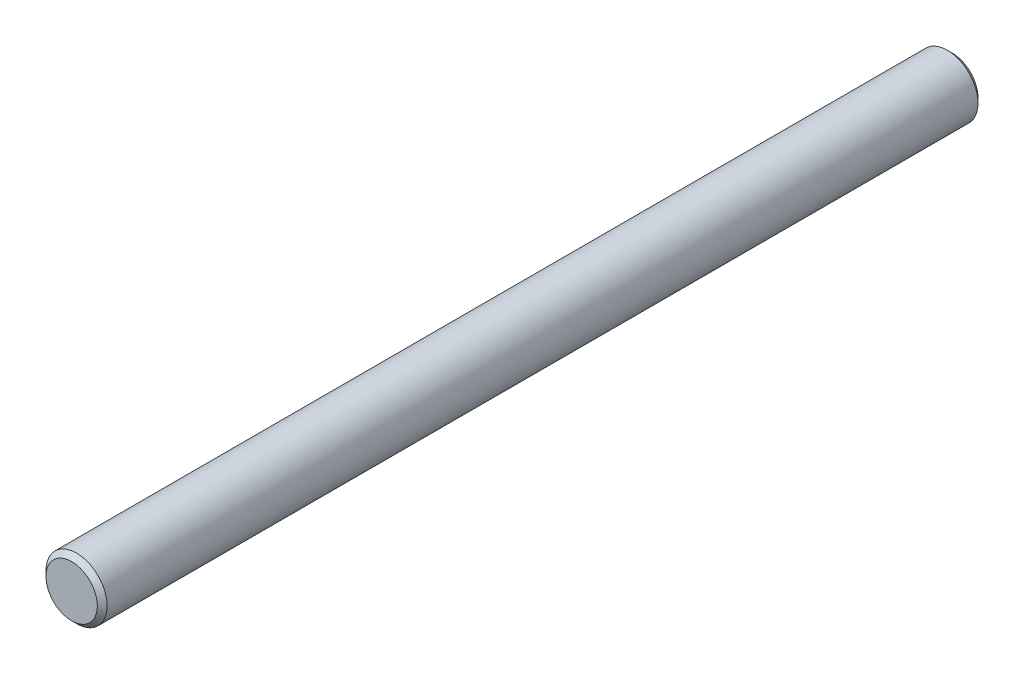
ISO-10303-21;
HEADER;
FILE_DESCRIPTION(('STEP AP214'),'2;1');
FILE_NAME('part.step','',(''),(''),'','','');
FILE_SCHEMA(('AUTOMOTIVE_DESIGN { 1 0 10303 214 1 1 1 1 }'));
ENDSEC;
DATA;
#1=APPLICATION_CONTEXT('core data for automotive mechanical design processes');
#2=APPLICATION_PROTOCOL_DEFINITION('international standard','automotive_design',2000,#1);
#3=PRODUCT_CONTEXT('',#1,'mechanical');
#4=PRODUCT('Part','Part','',(#3));
#5=PRODUCT_RELATED_PRODUCT_CATEGORY('part','',(#4));
#6=PRODUCT_DEFINITION_FORMATION('','',#4);
#7=PRODUCT_DEFINITION_CONTEXT('part definition',#1,'design');
#8=PRODUCT_DEFINITION('design','',#6,#7);
#9=PRODUCT_DEFINITION_SHAPE('','',#8);
#10=(LENGTH_UNIT() NAMED_UNIT(*) SI_UNIT(.MILLI.,.METRE.));
#11=(NAMED_UNIT(*) PLANE_ANGLE_UNIT() SI_UNIT($,.RADIAN.));
#12=(NAMED_UNIT(*) SI_UNIT($,.STERADIAN.) SOLID_ANGLE_UNIT());
#13=UNCERTAINTY_MEASURE_WITH_UNIT(LENGTH_MEASURE(1.E-05),#10,'distance_accuracy_value','');
#14=(GEOMETRIC_REPRESENTATION_CONTEXT(3) GLOBAL_UNCERTAINTY_ASSIGNED_CONTEXT((#13)) GLOBAL_UNIT_ASSIGNED_CONTEXT((#10,
#11,#12)) REPRESENTATION_CONTEXT('',''));
#15=CARTESIAN_POINT('',(0.,0.,0.));
#16=DIRECTION('',(0.,0.,1.));
#17=DIRECTION('',(1.,0.,0.));
#18=AXIS2_PLACEMENT_3D('',#15,#16,#17);
#19=CARTESIAN_POINT('',(0.,0.,45.72));
#20=DIRECTION('',(0.,0.,-1.));
#21=DIRECTION('',(-1.,0.,0.));
#22=AXIS2_PLACEMENT_3D('',#19,#20,#21);
#23=CYLINDRICAL_SURFACE('',#22,1.5875);
#24=CARTESIAN_POINT('',(0.,0.,45.466));
#25=DIRECTION('',(0.,0.,1.));
#26=DIRECTION('',(1.,0.,0.));
#27=AXIS2_PLACEMENT_3D('',#24,#25,#26);
#28=CIRCLE('',#27,1.5875);
#29=CARTESIAN_POINT('',(1.5875,0.,45.466));
#30=VERTEX_POINT('',#29);
#31=EDGE_CURVE('E40',#30,#30,#28,.F.);
#32=ORIENTED_EDGE('',*,*,#31,.T.);
#33=EDGE_LOOP('',(#32));
#34=FACE_BOUND('',#33,.T.);
#35=CARTESIAN_POINT('',(0.,0.,0.253999999999983));
#36=DIRECTION('',(0.,0.,1.));
#37=DIRECTION('',(1.,0.,0.));
#38=AXIS2_PLACEMENT_3D('',#35,#36,#37);
#39=CIRCLE('',#38,1.5875);
#40=CARTESIAN_POINT('',(1.5875,0.,0.253999999999983));
#41=VERTEX_POINT('',#40);
#42=EDGE_CURVE('E46',#41,#41,#39,.T.);
#43=ORIENTED_EDGE('',*,*,#42,.T.);
#44=EDGE_LOOP('',(#43));
#45=FACE_BOUND('',#44,.T.);
#46=ADVANCED_FACE('F32',(#34,#45),#23,.T.);
#47=CARTESIAN_POINT('',(0.,0.,45.72));
#48=DIRECTION('',(0.,0.,1.));
#49=DIRECTION('',(1.,0.,0.));
#50=AXIS2_PLACEMENT_3D('',#47,#48,#49);
#51=PLANE('',#50);
#52=CARTESIAN_POINT('',(0.,0.,45.72));
#53=DIRECTION('',(0.,0.,1.));
#54=DIRECTION('',(1.,0.,0.));
#55=AXIS2_PLACEMENT_3D('',#52,#53,#54);
#56=CIRCLE('',#55,1.3335);
#57=CARTESIAN_POINT('',(1.3335,0.,45.72));
#58=VERTEX_POINT('',#57);
#59=EDGE_CURVE('E51',#58,#58,#56,.T.);
#60=ORIENTED_EDGE('',*,*,#59,.T.);
#61=EDGE_LOOP('',(#60));
#62=FACE_BOUND('',#61,.T.);
#63=ADVANCED_FACE('F57',(#62),#51,.T.);
#64=CARTESIAN_POINT('',(0.,0.,0.));
#65=DIRECTION('',(0.,0.,1.));
#66=DIRECTION('',(1.,0.,0.));
#67=AXIS2_PLACEMENT_3D('',#64,#65,#66);
#68=PLANE('',#67);
#69=CARTESIAN_POINT('',(0.,0.,0.));
#70=DIRECTION('',(0.,0.,1.));
#71=DIRECTION('',(1.,0.,0.));
#72=AXIS2_PLACEMENT_3D('',#69,#70,#71);
#73=CIRCLE('',#72,1.33350000000001);
#74=CARTESIAN_POINT('',(1.33350000000001,0.,0.));
#75=VERTEX_POINT('',#74);
#76=EDGE_CURVE('E10',#75,#75,#73,.F.);
#77=ORIENTED_EDGE('',*,*,#76,.T.);
#78=EDGE_LOOP('',(#77));
#79=FACE_BOUND('',#78,.T.);
#80=ADVANCED_FACE('F61',(#79),#68,.F.);
#81=CARTESIAN_POINT('',(0.,0.,45.72));
#82=DIRECTION('',(0.,0.,-1.));
#83=DIRECTION('',(-1.,0.,0.));
#84=AXIS2_PLACEMENT_3D('',#81,#82,#83);
#85=CONICAL_SURFACE('',#84,1.3335,0.785398163397451);
#86=ORIENTED_EDGE('',*,*,#31,.F.);
#87=EDGE_LOOP('',(#86));
#88=FACE_BOUND('',#87,.T.);
#89=ORIENTED_EDGE('',*,*,#59,.F.);
#90=EDGE_LOOP('',(#89));
#91=FACE_BOUND('',#90,.T.);
#92=ADVANCED_FACE('F59',(#88,#91),#85,.T.);
#93=CARTESIAN_POINT('',(0.,0.,0.253999999999983));
#94=DIRECTION('',(0.,0.,1.));
#95=DIRECTION('',(1.,0.,0.));
#96=AXIS2_PLACEMENT_3D('',#93,#94,#95);
#97=CONICAL_SURFACE('',#96,1.5875,0.785398163397457);
#98=ORIENTED_EDGE('',*,*,#76,.F.);
#99=EDGE_LOOP('',(#98));
#100=FACE_BOUND('',#99,.T.);
#101=ORIENTED_EDGE('',*,*,#42,.F.);
#102=EDGE_LOOP('',(#101));
#103=FACE_BOUND('',#102,.T.);
#104=ADVANCED_FACE('F34',(#100,#103),#97,.T.);
#105=CLOSED_SHELL('',(#46,#63,#80,#92,#104));
#106=MANIFOLD_SOLID_BREP('B2',#105);
#107=ADVANCED_BREP_SHAPE_REPRESENTATION('',(#18,#106),#14);
#108=SHAPE_DEFINITION_REPRESENTATION(#9,#107);
ENDSEC;
END-ISO-10303-21;
